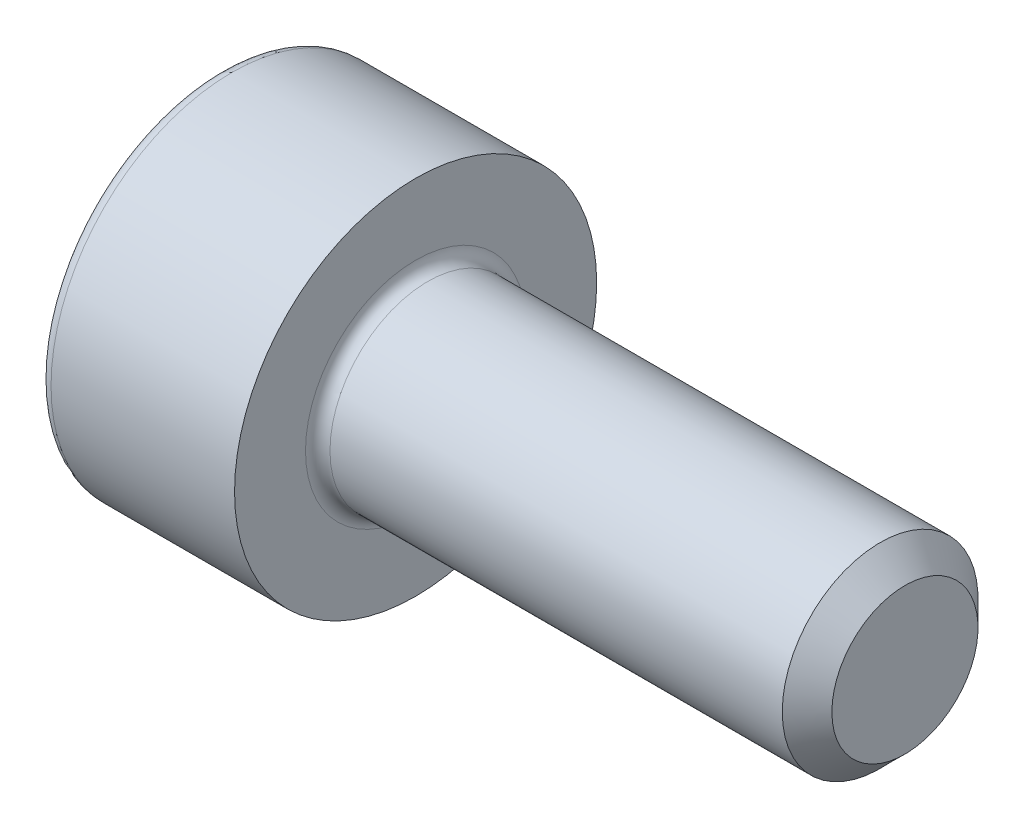
ISO-10303-21;
HEADER;
FILE_DESCRIPTION(('STEP AP214'),'2;1');
FILE_NAME('part.step','',(''),(''),'','','');
FILE_SCHEMA(('AUTOMOTIVE_DESIGN { 1 0 10303 214 1 1 1 1 }'));
ENDSEC;
DATA;
#1=APPLICATION_CONTEXT('core data for automotive mechanical design processes');
#2=APPLICATION_PROTOCOL_DEFINITION('international standard','automotive_design',2000,#1);
#3=PRODUCT_CONTEXT('',#1,'mechanical');
#4=PRODUCT('Part','Part','',(#3));
#5=PRODUCT_RELATED_PRODUCT_CATEGORY('part','',(#4));
#6=PRODUCT_DEFINITION_FORMATION('','',#4);
#7=PRODUCT_DEFINITION_CONTEXT('part definition',#1,'design');
#8=PRODUCT_DEFINITION('design','',#6,#7);
#9=PRODUCT_DEFINITION_SHAPE('','',#8);
#10=(LENGTH_UNIT() NAMED_UNIT(*) SI_UNIT(.MILLI.,.METRE.));
#11=(NAMED_UNIT(*) PLANE_ANGLE_UNIT() SI_UNIT($,.RADIAN.));
#12=(NAMED_UNIT(*) SI_UNIT($,.STERADIAN.) SOLID_ANGLE_UNIT());
#13=UNCERTAINTY_MEASURE_WITH_UNIT(LENGTH_MEASURE(1.E-05),#10,'distance_accuracy_value','');
#14=(GEOMETRIC_REPRESENTATION_CONTEXT(3) GLOBAL_UNCERTAINTY_ASSIGNED_CONTEXT((#13)) GLOBAL_UNIT_ASSIGNED_CONTEXT((#10,
#11,#12)) REPRESENTATION_CONTEXT('',''));
#15=CARTESIAN_POINT('',(0.,0.,0.));
#16=DIRECTION('',(0.,0.,1.));
#17=DIRECTION('',(1.,0.,0.));
#18=AXIS2_PLACEMENT_3D('',#15,#16,#17);
#19=CARTESIAN_POINT('',(5.,0.,0.));
#20=DIRECTION('',(-1.,0.,0.));
#21=DIRECTION('',(0.,0.,1.));
#22=AXIS2_PLACEMENT_3D('',#19,#20,#21);
#23=CONICAL_SURFACE('',#22,0.746499999993503,0.785398163397449);
#24=CARTESIAN_POINT('',(4.7464999999935,0.,0.));
#25=DIRECTION('',(-1.,0.,0.));
#26=DIRECTION('',(0.,0.,1.));
#27=AXIS2_PLACEMENT_3D('',#24,#25,#26);
#28=CIRCLE('',#27,1.);
#29=CARTESIAN_POINT('',(4.7464999999935,0.,1.));
#30=VERTEX_POINT('',#29);
#31=EDGE_CURVE('E11',#30,#30,#28,.T.);
#32=ORIENTED_EDGE('',*,*,#31,.F.);
#33=EDGE_LOOP('',(#32));
#34=FACE_BOUND('',#33,.T.);
#35=CARTESIAN_POINT('',(5.,0.,0.));
#36=DIRECTION('',(-1.,0.,0.));
#37=DIRECTION('',(0.,0.,1.));
#38=AXIS2_PLACEMENT_3D('',#35,#36,#37);
#39=CIRCLE('',#38,0.746499999993503);
#40=CARTESIAN_POINT('',(5.,0.,0.746499999993503));
#41=VERTEX_POINT('',#40);
#42=EDGE_CURVE('E133',#41,#41,#39,.T.);
#43=ORIENTED_EDGE('',*,*,#42,.T.);
#44=EDGE_LOOP('',(#43));
#45=FACE_BOUND('',#44,.T.);
#46=ADVANCED_FACE('F32',(#34,#45),#23,.T.);
#47=CARTESIAN_POINT('',(-2.,0.,0.));
#48=DIRECTION('',(-1.,0.,0.));
#49=DIRECTION('',(0.,0.,1.));
#50=AXIS2_PLACEMENT_3D('',#47,#48,#49);
#51=CYLINDRICAL_SURFACE('',#50,1.);
#52=CARTESIAN_POINT('',(0.125,0.,0.));
#53=DIRECTION('',(-1.,0.,0.));
#54=DIRECTION('',(0.,0.,1.));
#55=AXIS2_PLACEMENT_3D('',#52,#53,#54);
#56=CIRCLE('',#55,1.);
#57=CARTESIAN_POINT('',(0.125,0.,1.));
#58=VERTEX_POINT('',#57);
#59=EDGE_CURVE('E39',#58,#58,#56,.T.);
#60=ORIENTED_EDGE('',*,*,#59,.F.);
#61=EDGE_LOOP('',(#60));
#62=FACE_BOUND('',#61,.T.);
#63=ORIENTED_EDGE('',*,*,#31,.T.);
#64=EDGE_LOOP('',(#63));
#65=FACE_BOUND('',#64,.T.);
#66=ADVANCED_FACE('F157',(#62,#65),#51,.T.);
#67=CARTESIAN_POINT('',(0.125,0.,0.));
#68=DIRECTION('',(-1.,0.,0.));
#69=DIRECTION('',(0.,0.,1.));
#70=AXIS2_PLACEMENT_3D('',#67,#68,#69);
#71=TOROIDAL_SURFACE('',#70,1.125,0.125);
#72=CARTESIAN_POINT('',(0.,0.,0.));
#73=DIRECTION('',(-1.,0.,0.));
#74=DIRECTION('',(0.,0.,1.));
#75=AXIS2_PLACEMENT_3D('',#72,#73,#74);
#76=CIRCLE('',#75,1.125);
#77=CARTESIAN_POINT('',(0.,0.,1.125));
#78=VERTEX_POINT('',#77);
#79=EDGE_CURVE('E150',#78,#78,#76,.T.);
#80=ORIENTED_EDGE('',*,*,#79,.F.);
#81=EDGE_LOOP('',(#80));
#82=FACE_BOUND('',#81,.T.);
#83=ORIENTED_EDGE('',*,*,#59,.T.);
#84=EDGE_LOOP('',(#83));
#85=FACE_BOUND('',#84,.T.);
#86=ADVANCED_FACE('F155',(#82,#85),#71,.F.);
#87=CARTESIAN_POINT('',(0.,1.125,0.));
#88=DIRECTION('',(-1.,0.,0.));
#89=DIRECTION('',(0.,0.,1.));
#90=AXIS2_PLACEMENT_3D('',#87,#88,#89);
#91=PLANE('',#90);
#92=CARTESIAN_POINT('',(0.,0.,0.));
#93=DIRECTION('',(-1.,0.,0.));
#94=DIRECTION('',(0.,0.,1.));
#95=AXIS2_PLACEMENT_3D('',#92,#93,#94);
#96=CIRCLE('',#95,1.85);
#97=CARTESIAN_POINT('',(0.,0.,1.85));
#98=VERTEX_POINT('',#97);
#99=EDGE_CURVE('E147',#98,#98,#96,.T.);
#100=ORIENTED_EDGE('',*,*,#99,.F.);
#101=EDGE_LOOP('',(#100));
#102=FACE_BOUND('',#101,.T.);
#103=ORIENTED_EDGE('',*,*,#79,.T.);
#104=EDGE_LOOP('',(#103));
#105=FACE_BOUND('',#104,.T.);
#106=ADVANCED_FACE('F188',(#102,#105),#91,.F.);
#107=CARTESIAN_POINT('',(-2.,0.,0.));
#108=DIRECTION('',(-1.,0.,0.));
#109=DIRECTION('',(0.,0.,1.));
#110=AXIS2_PLACEMENT_3D('',#107,#108,#109);
#111=CYLINDRICAL_SURFACE('',#110,1.85);
#112=CARTESIAN_POINT('',(-1.875,0.,0.));
#113=DIRECTION('',(-1.,0.,0.));
#114=DIRECTION('',(0.,0.,1.));
#115=AXIS2_PLACEMENT_3D('',#112,#113,#114);
#116=CIRCLE('',#115,1.85);
#117=CARTESIAN_POINT('',(-1.875,0.,1.85));
#118=VERTEX_POINT('',#117);
#119=EDGE_CURVE('E144',#118,#118,#116,.T.);
#120=ORIENTED_EDGE('',*,*,#119,.F.);
#121=EDGE_LOOP('',(#120));
#122=FACE_BOUND('',#121,.T.);
#123=ORIENTED_EDGE('',*,*,#99,.T.);
#124=EDGE_LOOP('',(#123));
#125=FACE_BOUND('',#124,.T.);
#126=ADVANCED_FACE('F184',(#122,#125),#111,.T.);
#127=CARTESIAN_POINT('',(-1.875,0.,0.));
#128=DIRECTION('',(-1.,0.,0.));
#129=DIRECTION('',(0.,0.,1.));
#130=AXIS2_PLACEMENT_3D('',#127,#128,#129);
#131=TOROIDAL_SURFACE('',#130,1.725,0.125);
#132=CARTESIAN_POINT('',(-2.,0.,0.));
#133=DIRECTION('',(-1.,0.,0.));
#134=DIRECTION('',(0.,0.,1.));
#135=AXIS2_PLACEMENT_3D('',#132,#133,#134);
#136=CIRCLE('',#135,1.725);
#137=CARTESIAN_POINT('',(-2.,0.,1.725));
#138=VERTEX_POINT('',#137);
#139=EDGE_CURVE('E141',#138,#138,#136,.T.);
#140=ORIENTED_EDGE('',*,*,#139,.F.);
#141=EDGE_LOOP('',(#140));
#142=FACE_BOUND('',#141,.T.);
#143=ORIENTED_EDGE('',*,*,#119,.T.);
#144=EDGE_LOOP('',(#143));
#145=FACE_BOUND('',#144,.T.);
#146=ADVANCED_FACE('F177',(#142,#145),#131,.T.);
#147=CARTESIAN_POINT('',(-2.,1.725,0.));
#148=DIRECTION('',(1.,0.,0.));
#149=DIRECTION('',(0.,0.,-1.));
#150=AXIS2_PLACEMENT_3D('',#147,#148,#149);
#151=PLANE('',#150);
#152=DIRECTION('',(0.,0.5,-0.866025403784438));
#153=VECTOR('',#152,1.);
#154=CARTESIAN_POINT('',(-2.,0.433012701892219,0.75));
#155=LINE('',#154,#153);
#156=CARTESIAN_POINT('',(-2.,0.433012701892219,0.75));
#157=VERTEX_POINT('',#156);
#158=CARTESIAN_POINT('',(-2.,0.866025403784439,0.));
#159=VERTEX_POINT('',#158);
#160=EDGE_CURVE('E120',#157,#159,#155,.T.);
#161=ORIENTED_EDGE('',*,*,#160,.F.);
#162=DIRECTION('',(0.,1.,0.));
#163=VECTOR('',#162,1.);
#164=CARTESIAN_POINT('',(-2.,-0.43301270189222,0.75));
#165=LINE('',#164,#163);
#166=CARTESIAN_POINT('',(-2.,-0.43301270189222,0.75));
#167=VERTEX_POINT('',#166);
#168=EDGE_CURVE('E46',#167,#157,#165,.T.);
#169=ORIENTED_EDGE('',*,*,#168,.F.);
#170=DIRECTION('',(0.,0.5,0.866025403784439));
#171=VECTOR('',#170,1.);
#172=CARTESIAN_POINT('',(-2.,-0.866025403784439,0.));
#173=LINE('',#172,#171);
#174=CARTESIAN_POINT('',(-2.,-0.866025403784439,0.));
#175=VERTEX_POINT('',#174);
#176=EDGE_CURVE('E129',#175,#167,#173,.T.);
#177=ORIENTED_EDGE('',*,*,#176,.F.);
#178=DIRECTION('',(0.,-0.5,0.866025403784439));
#179=VECTOR('',#178,1.);
#180=CARTESIAN_POINT('',(-2.,-0.433012701892219,-0.75));
#181=LINE('',#180,#179);
#182=CARTESIAN_POINT('',(-2.,-0.433012701892219,-0.75));
#183=VERTEX_POINT('',#182);
#184=EDGE_CURVE('E127',#183,#175,#181,.T.);
#185=ORIENTED_EDGE('',*,*,#184,.F.);
#186=DIRECTION('',(0.,-1.,0.));
#187=VECTOR('',#186,1.);
#188=CARTESIAN_POINT('',(-2.,0.43301270189222,-0.75));
#189=LINE('',#188,#187);
#190=CARTESIAN_POINT('',(-2.,0.43301270189222,-0.75));
#191=VERTEX_POINT('',#190);
#192=EDGE_CURVE('E94',#191,#183,#189,.T.);
#193=ORIENTED_EDGE('',*,*,#192,.F.);
#194=DIRECTION('',(0.,-0.5,-0.866025403784439));
#195=VECTOR('',#194,1.);
#196=CARTESIAN_POINT('',(-2.,0.866025403784439,0.));
#197=LINE('',#196,#195);
#198=EDGE_CURVE('E123',#159,#191,#197,.T.);
#199=ORIENTED_EDGE('',*,*,#198,.F.);
#200=EDGE_LOOP('',(#161,#169,#177,#185,#193,#199));
#201=FACE_BOUND('',#200,.T.);
#202=ORIENTED_EDGE('',*,*,#139,.T.);
#203=EDGE_LOOP('',(#202));
#204=FACE_BOUND('',#203,.T.);
#205=ADVANCED_FACE('F169',(#201,#204),#151,.F.);
#206=CARTESIAN_POINT('',(5.,0.746499999993503,0.));
#207=DIRECTION('',(-1.,0.,0.));
#208=DIRECTION('',(0.,0.,1.));
#209=AXIS2_PLACEMENT_3D('',#206,#207,#208);
#210=PLANE('',#209);
#211=ORIENTED_EDGE('',*,*,#42,.F.);
#212=EDGE_LOOP('',(#211));
#213=FACE_BOUND('',#212,.T.);
#214=ADVANCED_FACE('F166',(#213),#210,.F.);
#215=CARTESIAN_POINT('',(-0.9,-0.43301270189222,0.75));
#216=DIRECTION('',(0.,0.,1.));
#217=DIRECTION('',(1.,0.,0.));
#218=AXIS2_PLACEMENT_3D('',#215,#216,#217);
#219=PLANE('',#218);
#220=ORIENTED_EDGE('',*,*,#168,.T.);
#221=DIRECTION('',(-1.,0.,0.));
#222=VECTOR('',#221,1.);
#223=CARTESIAN_POINT('',(-0.9,0.433012701892219,0.75));
#224=LINE('',#223,#222);
#225=CARTESIAN_POINT('',(-0.9,0.433012701892219,0.75));
#226=VERTEX_POINT('',#225);
#227=EDGE_CURVE('E76',#226,#157,#224,.T.);
#228=ORIENTED_EDGE('',*,*,#227,.F.);
#229=DIRECTION('',(0.,1.,0.));
#230=VECTOR('',#229,1.);
#231=CARTESIAN_POINT('',(-0.9,-0.43301270189222,0.75));
#232=LINE('',#231,#230);
#233=CARTESIAN_POINT('',(-0.9,-0.43301270189222,0.75));
#234=VERTEX_POINT('',#233);
#235=EDGE_CURVE('E131',#234,#226,#232,.T.);
#236=ORIENTED_EDGE('',*,*,#235,.F.);
#237=DIRECTION('',(-1.,0.,0.));
#238=VECTOR('',#237,1.);
#239=CARTESIAN_POINT('',(-0.9,-0.43301270189222,0.75));
#240=LINE('',#239,#238);
#241=EDGE_CURVE('E54',#234,#167,#240,.T.);
#242=ORIENTED_EDGE('',*,*,#241,.T.);
#243=EDGE_LOOP('',(#220,#228,#236,#242));
#244=FACE_BOUND('',#243,.T.);
#245=ADVANCED_FACE('F168',(#244),#219,.F.);
#246=CARTESIAN_POINT('',(-0.9,-0.866025403784439,0.));
#247=DIRECTION('',(0.,-0.866025403784439,0.5));
#248=DIRECTION('',(0.,-0.5,-0.866025403784439));
#249=AXIS2_PLACEMENT_3D('',#246,#247,#248);
#250=PLANE('',#249);
#251=ORIENTED_EDGE('',*,*,#176,.T.);
#252=ORIENTED_EDGE('',*,*,#241,.F.);
#253=DIRECTION('',(0.,0.5,0.866025403784439));
#254=VECTOR('',#253,1.);
#255=CARTESIAN_POINT('',(-0.9,-0.866025403784439,0.));
#256=LINE('',#255,#254);
#257=CARTESIAN_POINT('',(-0.9,-0.866025403784439,0.));
#258=VERTEX_POINT('',#257);
#259=EDGE_CURVE('E106',#258,#234,#256,.T.);
#260=ORIENTED_EDGE('',*,*,#259,.F.);
#261=DIRECTION('',(-1.,0.,0.));
#262=VECTOR('',#261,1.);
#263=CARTESIAN_POINT('',(-0.9,-0.866025403784439,0.));
#264=LINE('',#263,#262);
#265=EDGE_CURVE('E98',#258,#175,#264,.T.);
#266=ORIENTED_EDGE('',*,*,#265,.T.);
#267=EDGE_LOOP('',(#251,#252,#260,#266));
#268=FACE_BOUND('',#267,.T.);
#269=ADVANCED_FACE('F175',(#268),#250,.F.);
#270=CARTESIAN_POINT('',(-0.9,-0.433012701892219,-0.75));
#271=DIRECTION('',(0.,-0.866025403784439,-0.5));
#272=DIRECTION('',(0.,0.5,-0.866025403784439));
#273=AXIS2_PLACEMENT_3D('',#270,#271,#272);
#274=PLANE('',#273);
#275=ORIENTED_EDGE('',*,*,#184,.T.);
#276=ORIENTED_EDGE('',*,*,#265,.F.);
#277=DIRECTION('',(0.,-0.5,0.866025403784439));
#278=VECTOR('',#277,1.);
#279=CARTESIAN_POINT('',(-0.9,-0.433012701892219,-0.75));
#280=LINE('',#279,#278);
#281=CARTESIAN_POINT('',(-0.9,-0.433012701892219,-0.75));
#282=VERTEX_POINT('',#281);
#283=EDGE_CURVE('E102',#282,#258,#280,.T.);
#284=ORIENTED_EDGE('',*,*,#283,.F.);
#285=DIRECTION('',(-1.,0.,0.));
#286=VECTOR('',#285,1.);
#287=CARTESIAN_POINT('',(-0.9,-0.433012701892219,-0.75));
#288=LINE('',#287,#286);
#289=EDGE_CURVE('E87',#282,#183,#288,.T.);
#290=ORIENTED_EDGE('',*,*,#289,.T.);
#291=EDGE_LOOP('',(#275,#276,#284,#290));
#292=FACE_BOUND('',#291,.T.);
#293=ADVANCED_FACE('F103',(#292),#274,.F.);
#294=CARTESIAN_POINT('',(-0.9,0.43301270189222,-0.75));
#295=DIRECTION('',(0.,0.,-1.));
#296=DIRECTION('',(0.,1.,0.));
#297=AXIS2_PLACEMENT_3D('',#294,#295,#296);
#298=PLANE('',#297);
#299=ORIENTED_EDGE('',*,*,#192,.T.);
#300=ORIENTED_EDGE('',*,*,#289,.F.);
#301=DIRECTION('',(0.,-1.,0.));
#302=VECTOR('',#301,1.);
#303=CARTESIAN_POINT('',(-0.9,0.43301270189222,-0.75));
#304=LINE('',#303,#302);
#305=CARTESIAN_POINT('',(-0.9,0.43301270189222,-0.75));
#306=VERTEX_POINT('',#305);
#307=EDGE_CURVE('E91',#306,#282,#304,.T.);
#308=ORIENTED_EDGE('',*,*,#307,.F.);
#309=DIRECTION('',(-1.,0.,0.));
#310=VECTOR('',#309,1.);
#311=CARTESIAN_POINT('',(-0.9,0.43301270189222,-0.75));
#312=LINE('',#311,#310);
#313=EDGE_CURVE('E99',#306,#191,#312,.T.);
#314=ORIENTED_EDGE('',*,*,#313,.T.);
#315=EDGE_LOOP('',(#299,#300,#308,#314));
#316=FACE_BOUND('',#315,.T.);
#317=ADVANCED_FACE('F89',(#316),#298,.F.);
#318=CARTESIAN_POINT('',(-0.9,0.866025403784439,0.));
#319=DIRECTION('',(0.,0.866025403784439,-0.5));
#320=DIRECTION('',(0.,0.5,0.866025403784439));
#321=AXIS2_PLACEMENT_3D('',#318,#319,#320);
#322=PLANE('',#321);
#323=ORIENTED_EDGE('',*,*,#198,.T.);
#324=ORIENTED_EDGE('',*,*,#313,.F.);
#325=DIRECTION('',(0.,-0.5,-0.866025403784439));
#326=VECTOR('',#325,1.);
#327=CARTESIAN_POINT('',(-0.9,0.866025403784439,0.));
#328=LINE('',#327,#326);
#329=CARTESIAN_POINT('',(-0.9,0.866025403784439,0.));
#330=VERTEX_POINT('',#329);
#331=EDGE_CURVE('E112',#330,#306,#328,.T.);
#332=ORIENTED_EDGE('',*,*,#331,.F.);
#333=DIRECTION('',(-1.,0.,0.));
#334=VECTOR('',#333,1.);
#335=CARTESIAN_POINT('',(-0.9,0.866025403784439,0.));
#336=LINE('',#335,#334);
#337=EDGE_CURVE('E136',#330,#159,#336,.T.);
#338=ORIENTED_EDGE('',*,*,#337,.T.);
#339=EDGE_LOOP('',(#323,#324,#332,#338));
#340=FACE_BOUND('',#339,.T.);
#341=ADVANCED_FACE('F250',(#340),#322,.F.);
#342=CARTESIAN_POINT('',(-0.9,0.433012701892219,0.75));
#343=DIRECTION('',(0.,0.866025403784439,0.5));
#344=DIRECTION('',(0.,-0.5,0.866025403784438));
#345=AXIS2_PLACEMENT_3D('',#342,#343,#344);
#346=PLANE('',#345);
#347=ORIENTED_EDGE('',*,*,#160,.T.);
#348=ORIENTED_EDGE('',*,*,#337,.F.);
#349=DIRECTION('',(0.,0.5,-0.866025403784438));
#350=VECTOR('',#349,1.);
#351=CARTESIAN_POINT('',(-0.9,0.433012701892219,0.75));
#352=LINE('',#351,#350);
#353=EDGE_CURVE('E114',#226,#330,#352,.T.);
#354=ORIENTED_EDGE('',*,*,#353,.F.);
#355=ORIENTED_EDGE('',*,*,#227,.T.);
#356=EDGE_LOOP('',(#347,#348,#354,#355));
#357=FACE_BOUND('',#356,.T.);
#358=ADVANCED_FACE('F259',(#357),#346,.F.);
#359=CARTESIAN_POINT('',(-0.9,0.,0.));
#360=DIRECTION('',(-1.,0.,0.));
#361=DIRECTION('',(0.,0.,1.));
#362=AXIS2_PLACEMENT_3D('',#359,#360,#361);
#363=PLANE('',#362);
#364=ORIENTED_EDGE('',*,*,#235,.T.);
#365=ORIENTED_EDGE('',*,*,#353,.T.);
#366=ORIENTED_EDGE('',*,*,#331,.T.);
#367=ORIENTED_EDGE('',*,*,#307,.T.);
#368=ORIENTED_EDGE('',*,*,#283,.T.);
#369=ORIENTED_EDGE('',*,*,#259,.T.);
#370=EDGE_LOOP('',(#364,#365,#366,#367,#368,#369));
#371=FACE_BOUND('',#370,.T.);
#372=ADVANCED_FACE('F109',(#371),#363,.T.);
#373=CLOSED_SHELL('',(#46,#66,#86,#106,#126,#146,#205,#214,#245,#269,#293,#317,#341,#358,#372));
#374=MANIFOLD_SOLID_BREP('B2',#373);
#375=ADVANCED_BREP_SHAPE_REPRESENTATION('',(#18,#374),#14);
#376=SHAPE_DEFINITION_REPRESENTATION(#9,#375);
ENDSEC;
END-ISO-10303-21;
